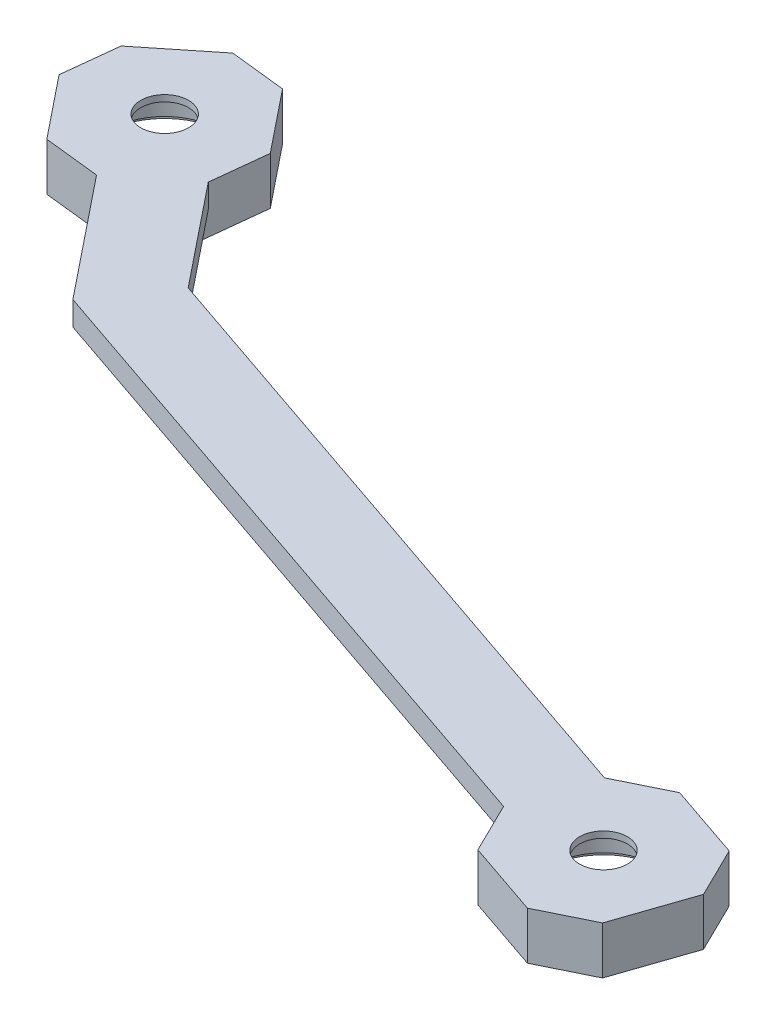
ISO-10303-21;
HEADER;
FILE_DESCRIPTION(('STEP AP214'),'2;1');
FILE_NAME('part.step','',(''),(''),'','','');
FILE_SCHEMA(('AUTOMOTIVE_DESIGN { 1 0 10303 214 1 1 1 1 }'));
ENDSEC;
DATA;
#1=APPLICATION_CONTEXT('core data for automotive mechanical design processes');
#2=APPLICATION_PROTOCOL_DEFINITION('international standard','automotive_design',2000,#1);
#3=PRODUCT_CONTEXT('',#1,'mechanical');
#4=PRODUCT('Part','Part','',(#3));
#5=PRODUCT_RELATED_PRODUCT_CATEGORY('part','',(#4));
#6=PRODUCT_DEFINITION_FORMATION('','',#4);
#7=PRODUCT_DEFINITION_CONTEXT('part definition',#1,'design');
#8=PRODUCT_DEFINITION('design','',#6,#7);
#9=PRODUCT_DEFINITION_SHAPE('','',#8);
#10=(LENGTH_UNIT() NAMED_UNIT(*) SI_UNIT(.MILLI.,.METRE.));
#11=(NAMED_UNIT(*) PLANE_ANGLE_UNIT() SI_UNIT($,.RADIAN.));
#12=(NAMED_UNIT(*) SI_UNIT($,.STERADIAN.) SOLID_ANGLE_UNIT());
#13=UNCERTAINTY_MEASURE_WITH_UNIT(LENGTH_MEASURE(1.E-05),#10,'distance_accuracy_value','');
#14=(GEOMETRIC_REPRESENTATION_CONTEXT(3) GLOBAL_UNCERTAINTY_ASSIGNED_CONTEXT((#13)) GLOBAL_UNIT_ASSIGNED_CONTEXT((#10,
#11,#12)) REPRESENTATION_CONTEXT('',''));
#15=CARTESIAN_POINT('',(0.,0.,0.));
#16=DIRECTION('',(0.,0.,1.));
#17=DIRECTION('',(1.,0.,0.));
#18=AXIS2_PLACEMENT_3D('',#15,#16,#17);
#19=CARTESIAN_POINT('',(74.766954061,-74.500004703,201.229691723));
#20=DIRECTION('',(0.228679370018642,0.707106781057643,-0.669108172054546));
#21=DIRECTION('',(-0.946261851441707,0.,-0.323401466456343));
#22=AXIS2_PLACEMENT_3D('',#19,#20,#21);
#23=PLANE('',#22);
#24=DIRECTION('',(0.359608611128638,0.577350269206526,0.733040458262219));
#25=VECTOR('',#24,1.);
#26=CARTESIAN_POINT('',(121.581452612,-77.500004703,214.05899204));
#27=LINE('',#26,#25);
#28=CARTESIAN_POINT('',(121.581452612,-77.500004703,214.05899204));
#29=VERTEX_POINT('',#28);
#30=CARTESIAN_POINT('',(123.450033768,-74.500004703,217.867981993));
#31=VERTEX_POINT('',#30);
#32=EDGE_CURVE('E295',#29,#31,#27,.T.);
#33=ORIENTED_EDGE('',*,*,#32,.T.);
#34=DIRECTION('',(-0.946261851639749,0.,-0.323401465876878));
#35=VECTOR('',#34,1.);
#36=CARTESIAN_POINT('',(123.450033768,-74.500004703,217.867981993));
#37=LINE('',#36,#35);
#38=CARTESIAN_POINT('',(41.122464529,-74.500004703,189.731101532));
#39=VERTEX_POINT('',#38);
#40=EDGE_CURVE('E327',#31,#39,#37,.T.);
#41=ORIENTED_EDGE('',*,*,#40,.T.);
#42=DIRECTION('',(-0.414389388031988,0.692646805053467,0.590357382045571));
#43=VECTOR('',#42,1.);
#44=CARTESIAN_POINT('',(42.917272729,-77.500004703,187.174138686));
#45=LINE('',#44,#43);
#46=CARTESIAN_POINT('',(42.917272729,-77.500004703,187.174138686));
#47=VERTEX_POINT('',#46);
#48=EDGE_CURVE('E10',#47,#39,#45,.T.);
#49=ORIENTED_EDGE('',*,*,#48,.F.);
#50=DIRECTION('',(0.946261851639749,0.,0.323401465876878));
#51=VECTOR('',#50,1.);
#52=CARTESIAN_POINT('',(42.917272729,-77.500004703,187.174138686));
#53=LINE('',#52,#51);
#54=EDGE_CURVE('E291',#47,#29,#53,.T.);
#55=ORIENTED_EDGE('',*,*,#54,.T.);
#56=EDGE_LOOP('',(#33,#41,#49,#55));
#57=FACE_BOUND('',#56,.T.);
#58=ADVANCED_FACE('F15',(#57),#23,.F.);
#59=CARTESIAN_POINT('',(-19.769404594,-77.500004703,109.030283541));
#60=DIRECTION('',(-0.551566324964118,-0.707106780953999,0.442464223971215));
#61=DIRECTION('',(-0.788489848802859,0.615047769148743,0.));
#62=AXIS2_PLACEMENT_3D('',#59,#60,#61);
#63=PLANE('',#62);
#64=DIRECTION('',(0.811622544300158,-0.577350269213518,0.0890814920329446));
#65=VECTOR('',#64,1.);
#66=CARTESIAN_POINT('',(29.042605868,-74.500004703,174.672611185));
#67=LINE('',#66,#65);
#68=CARTESIAN_POINT('',(29.042605868,-74.500004703,174.672611185));
#69=VERTEX_POINT('',#68);
#70=CARTESIAN_POINT('',(33.259920318,-77.500004703,175.135492197));
#71=VERTEX_POINT('',#70);
#72=EDGE_CURVE('E454',#69,#71,#67,.T.);
#73=ORIENTED_EDGE('',*,*,#72,.T.);
#74=DIRECTION('',(0.625738906105331,0.,0.780032577131304));
#75=VECTOR('',#74,1.);
#76=CARTESIAN_POINT('',(33.259920318,-77.500004703,175.135492197));
#77=LINE('',#76,#75);
#78=EDGE_CURVE('E300',#71,#47,#77,.T.);
#79=ORIENTED_EDGE('',*,*,#78,.T.);
#80=ORIENTED_EDGE('',*,*,#48,.T.);
#81=DIRECTION('',(-0.625738906105331,0.,-0.780032577131304));
#82=VECTOR('',#81,1.);
#83=CARTESIAN_POINT('',(41.122464529,-74.500004703,189.731101532));
#84=LINE('',#83,#82);
#85=EDGE_CURVE('E416',#39,#69,#84,.T.);
#86=ORIENTED_EDGE('',*,*,#85,.T.);
#87=EDGE_LOOP('',(#73,#79,#80,#86));
#88=FACE_BOUND('',#87,.T.);
#89=ADVANCED_FACE('F727',(#88),#63,.T.);
#90=CARTESIAN_POINT('',(23.761202041,-77.500004703,176.400058202));
#91=DIRECTION('',(0.228679370018642,-0.707106781057643,-0.669108172054546));
#92=DIRECTION('',(0.,0.687320942999468,-0.726353854064479));
#93=AXIS2_PLACEMENT_3D('',#90,#91,#92);
#94=PLANE('',#93);
#95=DIRECTION('',(-0.733040458262219,-0.577350269206526,0.359608611128637));
#96=VECTOR('',#95,1.);
#97=CARTESIAN_POINT('',(126.684048431,-74.500004703,208.405363478));
#98=LINE('',#97,#96);
#99=CARTESIAN_POINT('',(126.684048431,-74.500004703,208.405363478));
#100=VERTEX_POINT('',#99);
#101=CARTESIAN_POINT('',(122.875058477,-77.500004703,210.273944634));
#102=VERTEX_POINT('',#101);
#103=EDGE_CURVE('E591',#100,#102,#98,.T.);
#104=ORIENTED_EDGE('',*,*,#103,.T.);
#105=DIRECTION('',(-0.946261851639749,0.,-0.323401465876878));
#106=VECTOR('',#105,1.);
#107=CARTESIAN_POINT('',(122.875058477,-77.500004703,210.273944634));
#108=LINE('',#107,#106);
#109=CARTESIAN_POINT('',(45.310350329,-77.500004703,183.764854892));
#110=VERTEX_POINT('',#109);
#111=EDGE_CURVE('E358',#102,#110,#108,.T.);
#112=ORIENTED_EDGE('',*,*,#111,.T.);
#113=DIRECTION('',(-0.414389388031988,-0.692646805053467,0.590357382045571));
#114=VECTOR('',#113,1.);
#115=CARTESIAN_POINT('',(47.105158529,-74.500004703,181.207892047));
#116=LINE('',#115,#114);
#117=CARTESIAN_POINT('',(47.105158529,-74.500004703,181.207892047));
#118=VERTEX_POINT('',#117);
#119=EDGE_CURVE('E26',#118,#110,#116,.T.);
#120=ORIENTED_EDGE('',*,*,#119,.F.);
#121=DIRECTION('',(0.946261851639749,0.,0.323401465876878));
#122=VECTOR('',#121,1.);
#123=CARTESIAN_POINT('',(47.105158529,-74.500004703,181.207892047));
#124=LINE('',#123,#122);
#125=EDGE_CURVE('E390',#118,#100,#124,.T.);
#126=ORIENTED_EDGE('',*,*,#125,.T.);
#127=EDGE_LOOP('',(#104,#112,#120,#126));
#128=FACE_BOUND('',#127,.T.);
#129=ADVANCED_FACE('F733',(#128),#94,.T.);
#130=CARTESIAN_POINT('',(41.974045084,-74.500004703,174.811557084));
#131=DIRECTION('',(-0.551566324964118,0.707106780953999,0.442464223971215));
#132=DIRECTION('',(0.625738906199191,0.,0.78003257705601));
#133=AXIS2_PLACEMENT_3D('',#130,#131,#132);
#134=PLANE('',#133);
#135=DIRECTION('',(0.0890814920329446,0.577350269213518,-0.811622544300158));
#136=VECTOR('',#135,1.);
#137=CARTESIAN_POINT('',(36.380050626,-77.500004703,172.632536571));
#138=LINE('',#137,#136);
#139=CARTESIAN_POINT('',(36.380050626,-77.500004703,172.632536571));
#140=VERTEX_POINT('',#139);
#141=CARTESIAN_POINT('',(36.842931638,-74.500004703,168.415222122));
#142=VERTEX_POINT('',#141);
#143=EDGE_CURVE('E352',#140,#142,#138,.T.);
#144=ORIENTED_EDGE('',*,*,#143,.T.);
#145=DIRECTION('',(0.625738906105331,0.,0.780032577131304));
#146=VECTOR('',#145,1.);
#147=CARTESIAN_POINT('',(36.842931638,-74.500004703,168.415222122));
#148=LINE('',#147,#146);
#149=EDGE_CURVE('E353',#142,#118,#148,.T.);
#150=ORIENTED_EDGE('',*,*,#149,.T.);
#151=ORIENTED_EDGE('',*,*,#119,.T.);
#152=DIRECTION('',(-0.625738906105331,0.,-0.780032577131304));
#153=VECTOR('',#152,1.);
#154=CARTESIAN_POINT('',(45.310350329,-77.500004703,183.764854892));
#155=LINE('',#154,#153);
#156=EDGE_CURVE('E441',#110,#140,#155,.T.);
#157=ORIENTED_EDGE('',*,*,#156,.T.);
#158=EDGE_LOOP('',(#144,#150,#151,#157));
#159=FACE_BOUND('',#158,.T.);
#160=ADVANCED_FACE('F632',(#159),#134,.F.);
#161=CARTESIAN_POINT('',(-0.398787476,-72.300004703,-49.902779812));
#162=DIRECTION('',(0.,-1.,0.));
#163=DIRECTION('',(0.,0.,-1.));
#164=AXIS2_PLACEMENT_3D('',#161,#162,#163);
#165=PLANE('',#164);
#166=CARTESIAN_POINT('',(26.68537969,-72.300004703,163.743590884));
#167=DIRECTION('',(0.,1.,0.));
#168=DIRECTION('',(0.958322574538044,0.,-0.285688367160398));
#169=AXIS2_PLACEMENT_3D('',#166,#167,#168);
#170=CIRCLE('',#169,6.7);
#171=CARTESIAN_POINT('',(20.264618441,-72.300004703,165.657702945));
#172=VERTEX_POINT('',#171);
#173=CARTESIAN_POINT('',(33.106140939,-72.300004703,161.829478822));
#174=VERTEX_POINT('',#173);
#175=EDGE_CURVE('E378',#172,#174,#170,.T.);
#176=ORIENTED_EDGE('',*,*,#175,.F.);
#177=CARTESIAN_POINT('',(26.68537969,-72.300004703,163.743590884));
#178=DIRECTION('',(0.,1.,0.));
#179=DIRECTION('',(0.958322574538044,0.,-0.285688367160398));
#180=AXIS2_PLACEMENT_3D('',#177,#178,#179);
#181=CIRCLE('',#180,6.7);
#182=EDGE_CURVE('E39',#174,#172,#181,.T.);
#183=ORIENTED_EDGE('',*,*,#182,.F.);
#184=EDGE_LOOP('',(#176,#183));
#185=FACE_BOUND('',#184,.T.);
#186=CARTESIAN_POINT('',(26.68537969,-72.300004703,163.743590884));
#187=DIRECTION('',(0.,1.,0.));
#188=DIRECTION('',(0.285688367160398,0.,0.958322574538044));
#189=AXIS2_PLACEMENT_3D('',#186,#187,#188);
#190=CIRCLE('',#189,3.);
#191=CARTESIAN_POINT('',(27.542444792,-72.300004703,166.618558607));
#192=VERTEX_POINT('',#191);
#193=CARTESIAN_POINT('',(23.810411966,-72.300004703,164.600655986));
#194=VERTEX_POINT('',#193);
#195=EDGE_CURVE('E450',#192,#194,#190,.T.);
#196=ORIENTED_EDGE('',*,*,#195,.T.);
#197=CARTESIAN_POINT('',(26.68537969,-72.300004703,163.743590884));
#198=DIRECTION('',(0.,1.,0.));
#199=DIRECTION('',(0.285688367160398,0.,0.958322574538044));
#200=AXIS2_PLACEMENT_3D('',#197,#198,#199);
#201=CIRCLE('',#200,3.);
#202=EDGE_CURVE('E336',#194,#192,#201,.T.);
#203=ORIENTED_EDGE('',*,*,#202,.T.);
#204=EDGE_LOOP('',(#196,#203));
#205=FACE_BOUND('',#204,.T.);
#206=ADVANCED_FACE('F629',(#185,#205),#165,.T.);
#207=CARTESIAN_POINT('',(26.68537969,-76.500004703,163.743590884));
#208=DIRECTION('',(0.,1.,0.));
#209=DIRECTION('',(-0.958322574538044,0.,0.285688367160398));
#210=AXIS2_PLACEMENT_3D('',#207,#208,#209);
#211=CYLINDRICAL_SURFACE('',#210,6.7);
#212=DIRECTION('',(0.,-1.,0.));
#213=VECTOR('',#212,1.);
#214=CARTESIAN_POINT('',(20.264618441,-72.300004703,165.657702945));
#215=LINE('',#214,#213);
#216=CARTESIAN_POINT('',(20.264618441,-76.500004703,165.657702945));
#217=VERTEX_POINT('',#216);
#218=EDGE_CURVE('E369',#172,#217,#215,.T.);
#219=ORIENTED_EDGE('',*,*,#218,.F.);
#220=ORIENTED_EDGE('',*,*,#175,.T.);
#221=ORIENTED_EDGE('',*,*,#182,.T.);
#222=ORIENTED_EDGE('',*,*,#218,.T.);
#223=CARTESIAN_POINT('',(26.68537969,-76.500004703,163.743590884));
#224=DIRECTION('',(0.,1.,0.));
#225=DIRECTION('',(0.958322574538044,0.,-0.285688367160398));
#226=AXIS2_PLACEMENT_3D('',#223,#224,#225);
#227=CIRCLE('',#226,6.7);
#228=CARTESIAN_POINT('',(33.106140939,-76.500004703,161.829478822));
#229=VERTEX_POINT('',#228);
#230=EDGE_CURVE('E362',#229,#217,#227,.T.);
#231=ORIENTED_EDGE('',*,*,#230,.F.);
#232=CARTESIAN_POINT('',(26.68537969,-76.500004703,163.743590884));
#233=DIRECTION('',(0.,1.,0.));
#234=DIRECTION('',(0.958322574538044,0.,-0.285688367160398));
#235=AXIS2_PLACEMENT_3D('',#232,#233,#234);
#236=CIRCLE('',#235,6.7);
#237=EDGE_CURVE('E463',#217,#229,#236,.T.);
#238=ORIENTED_EDGE('',*,*,#237,.F.);
#239=EDGE_LOOP('',(#219,#220,#221,#222,#231,#238));
#240=FACE_BOUND('',#239,.T.);
#241=ADVANCED_FACE('F628',(#240),#211,.F.);
#242=CARTESIAN_POINT('',(107.445492449,-72.300004703,2.724316702));
#243=DIRECTION('',(0.,-1.,0.));
#244=DIRECTION('',(0.,0.,-1.));
#245=AXIS2_PLACEMENT_3D('',#242,#243,#244);
#246=PLANE('',#245);
#247=CARTESIAN_POINT('',(134.529659615,-72.300004703,216.370687398));
#248=DIRECTION('',(0.,1.,0.));
#249=DIRECTION('',(0.958322574538044,0.,-0.285688367160398));
#250=AXIS2_PLACEMENT_3D('',#247,#248,#249);
#251=CIRCLE('',#250,6.7);
#252=CARTESIAN_POINT('',(128.108898366,-72.300004703,218.284799459));
#253=VERTEX_POINT('',#252);
#254=CARTESIAN_POINT('',(140.950420864,-72.300004703,214.456575336));
#255=VERTEX_POINT('',#254);
#256=EDGE_CURVE('E370',#253,#255,#251,.T.);
#257=ORIENTED_EDGE('',*,*,#256,.F.);
#258=CARTESIAN_POINT('',(134.529659615,-72.300004703,216.370687398));
#259=DIRECTION('',(0.,1.,0.));
#260=DIRECTION('',(0.958322574538044,0.,-0.285688367160398));
#261=AXIS2_PLACEMENT_3D('',#258,#259,#260);
#262=CIRCLE('',#261,6.7);
#263=EDGE_CURVE('E367',#255,#253,#262,.T.);
#264=ORIENTED_EDGE('',*,*,#263,.F.);
#265=EDGE_LOOP('',(#257,#264));
#266=FACE_BOUND('',#265,.T.);
#267=CARTESIAN_POINT('',(134.529659615,-72.300004703,216.370687398));
#268=DIRECTION('',(0.,1.,0.));
#269=DIRECTION('',(0.285688367160398,0.,0.958322574538044));
#270=AXIS2_PLACEMENT_3D('',#267,#268,#269);
#271=CIRCLE('',#270,3.);
#272=CARTESIAN_POINT('',(135.386724717,-72.300004703,219.245655121));
#273=VERTEX_POINT('',#272);
#274=CARTESIAN_POINT('',(131.654691891,-72.300004703,217.2277525));
#275=VERTEX_POINT('',#274);
#276=EDGE_CURVE('E501',#273,#275,#271,.T.);
#277=ORIENTED_EDGE('',*,*,#276,.T.);
#278=CARTESIAN_POINT('',(134.529659615,-72.300004703,216.370687398));
#279=DIRECTION('',(0.,1.,0.));
#280=DIRECTION('',(0.285688367160398,0.,0.958322574538044));
#281=AXIS2_PLACEMENT_3D('',#278,#279,#280);
#282=CIRCLE('',#281,3.);
#283=EDGE_CURVE('E505',#275,#273,#282,.T.);
#284=ORIENTED_EDGE('',*,*,#283,.T.);
#285=EDGE_LOOP('',(#277,#284));
#286=FACE_BOUND('',#285,.T.);
#287=ADVANCED_FACE('F710',(#266,#286),#246,.T.);
#288=CARTESIAN_POINT('',(134.529659615,-76.500004703,216.370687398));
#289=DIRECTION('',(0.,1.,0.));
#290=DIRECTION('',(-0.958322574538044,0.,0.285688367160398));
#291=AXIS2_PLACEMENT_3D('',#288,#289,#290);
#292=CYLINDRICAL_SURFACE('',#291,6.7);
#293=DIRECTION('',(0.,-1.,0.));
#294=VECTOR('',#293,1.);
#295=CARTESIAN_POINT('',(128.108898366,-72.300004703,218.284799459));
#296=LINE('',#295,#294);
#297=CARTESIAN_POINT('',(128.108898366,-76.500004703,218.284799459));
#298=VERTEX_POINT('',#297);
#299=EDGE_CURVE('E365',#253,#298,#296,.T.);
#300=ORIENTED_EDGE('',*,*,#299,.F.);
#301=ORIENTED_EDGE('',*,*,#256,.T.);
#302=ORIENTED_EDGE('',*,*,#263,.T.);
#303=ORIENTED_EDGE('',*,*,#299,.T.);
#304=CARTESIAN_POINT('',(134.529659615,-76.500004703,216.370687398));
#305=DIRECTION('',(0.,1.,0.));
#306=DIRECTION('',(0.958322574538044,0.,-0.285688367160398));
#307=AXIS2_PLACEMENT_3D('',#304,#305,#306);
#308=CIRCLE('',#307,6.7);
#309=CARTESIAN_POINT('',(140.950420864,-76.500004703,214.456575336));
#310=VERTEX_POINT('',#309);
#311=EDGE_CURVE('E366',#310,#298,#308,.T.);
#312=ORIENTED_EDGE('',*,*,#311,.F.);
#313=CARTESIAN_POINT('',(134.529659615,-76.500004703,216.370687398));
#314=DIRECTION('',(0.,1.,0.));
#315=DIRECTION('',(0.958322574538044,0.,-0.285688367160398));
#316=AXIS2_PLACEMENT_3D('',#313,#314,#315);
#317=CIRCLE('',#316,6.7);
#318=EDGE_CURVE('E363',#298,#310,#317,.T.);
#319=ORIENTED_EDGE('',*,*,#318,.F.);
#320=EDGE_LOOP('',(#300,#301,#302,#303,#312,#319));
#321=FACE_BOUND('',#320,.T.);
#322=ADVANCED_FACE('F712',(#321),#292,.F.);
#323=CARTESIAN_POINT('',(107.445492449,-76.500004703,2.724316702));
#324=DIRECTION('',(0.,-1.,0.));
#325=DIRECTION('',(0.,0.,-1.));
#326=AXIS2_PLACEMENT_3D('',#323,#324,#325);
#327=PLANE('',#326);
#328=CARTESIAN_POINT('',(134.529659615,-76.500004703,216.370687398));
#329=DIRECTION('',(0.,1.,0.));
#330=DIRECTION('',(0.958322574538044,0.,-0.285688367160398));
#331=AXIS2_PLACEMENT_3D('',#328,#329,#330);
#332=CIRCLE('',#331,7.8);
#333=CARTESIAN_POINT('',(127.054743534,-76.500004703,218.599056663));
#334=VERTEX_POINT('',#333);
#335=CARTESIAN_POINT('',(142.004575696,-76.500004703,214.142318132));
#336=VERTEX_POINT('',#335);
#337=EDGE_CURVE('E462',#334,#336,#332,.T.);
#338=ORIENTED_EDGE('',*,*,#337,.F.);
#339=CARTESIAN_POINT('',(134.529659615,-76.500004703,216.370687398));
#340=DIRECTION('',(0.,1.,0.));
#341=DIRECTION('',(0.958322574538044,0.,-0.285688367160398));
#342=AXIS2_PLACEMENT_3D('',#339,#340,#341);
#343=CIRCLE('',#342,7.8);
#344=EDGE_CURVE('E470',#336,#334,#343,.T.);
#345=ORIENTED_EDGE('',*,*,#344,.F.);
#346=EDGE_LOOP('',(#338,#345));
#347=FACE_BOUND('',#346,.T.);
#348=ORIENTED_EDGE('',*,*,#311,.T.);
#349=ORIENTED_EDGE('',*,*,#318,.T.);
#350=EDGE_LOOP('',(#348,#349));
#351=FACE_BOUND('',#350,.T.);
#352=ADVANCED_FACE('F721',(#347,#351),#327,.T.);
#353=CARTESIAN_POINT('',(134.529659615,-77.500004703,216.370687398));
#354=DIRECTION('',(0.,1.,0.));
#355=DIRECTION('',(-0.958322574538044,0.,0.285688367160398));
#356=AXIS2_PLACEMENT_3D('',#353,#354,#355);
#357=CYLINDRICAL_SURFACE('',#356,7.8);
#358=DIRECTION('',(0.,-1.,0.));
#359=VECTOR('',#358,1.);
#360=CARTESIAN_POINT('',(127.054743534,-76.500004703,218.599056663));
#361=LINE('',#360,#359);
#362=CARTESIAN_POINT('',(127.054743534,-77.500004703,218.599056663));
#363=VERTEX_POINT('',#362);
#364=EDGE_CURVE('E459',#334,#363,#361,.T.);
#365=ORIENTED_EDGE('',*,*,#364,.F.);
#366=ORIENTED_EDGE('',*,*,#337,.T.);
#367=ORIENTED_EDGE('',*,*,#344,.T.);
#368=ORIENTED_EDGE('',*,*,#364,.T.);
#369=CARTESIAN_POINT('',(134.529659615,-77.500004703,216.370687398));
#370=DIRECTION('',(0.,1.,0.));
#371=DIRECTION('',(0.958322574538044,0.,-0.285688367160398));
#372=AXIS2_PLACEMENT_3D('',#369,#370,#371);
#373=CIRCLE('',#372,7.8);
#374=CARTESIAN_POINT('',(142.004575696,-77.500004703,214.142318132));
#375=VERTEX_POINT('',#374);
#376=EDGE_CURVE('E341',#375,#363,#373,.T.);
#377=ORIENTED_EDGE('',*,*,#376,.F.);
#378=CARTESIAN_POINT('',(134.529659615,-77.500004703,216.370687398));
#379=DIRECTION('',(0.,1.,0.));
#380=DIRECTION('',(0.958322574538044,0.,-0.285688367160398));
#381=AXIS2_PLACEMENT_3D('',#378,#379,#380);
#382=CIRCLE('',#381,7.8);
#383=EDGE_CURVE('E337',#363,#375,#382,.T.);
#384=ORIENTED_EDGE('',*,*,#383,.F.);
#385=EDGE_LOOP('',(#365,#366,#367,#368,#377,#384));
#386=FACE_BOUND('',#385,.T.);
#387=ADVANCED_FACE('F741',(#386),#357,.F.);
#388=CARTESIAN_POINT('',(-0.398787476,-76.500004703,-49.902779812));
#389=DIRECTION('',(0.,-1.,0.));
#390=DIRECTION('',(0.,0.,-1.));
#391=AXIS2_PLACEMENT_3D('',#388,#389,#390);
#392=PLANE('',#391);
#393=CARTESIAN_POINT('',(26.68537969,-76.500004703,163.743590884));
#394=DIRECTION('',(0.,1.,0.));
#395=DIRECTION('',(0.958322574538044,0.,-0.285688367160398));
#396=AXIS2_PLACEMENT_3D('',#393,#394,#395);
#397=CIRCLE('',#396,7.8);
#398=CARTESIAN_POINT('',(19.210463609,-76.500004703,165.971960149));
#399=VERTEX_POINT('',#398);
#400=CARTESIAN_POINT('',(34.160295771,-76.500004703,161.515221618));
#401=VERTEX_POINT('',#400);
#402=EDGE_CURVE('E357',#399,#401,#397,.T.);
#403=ORIENTED_EDGE('',*,*,#402,.F.);
#404=CARTESIAN_POINT('',(26.68537969,-76.500004703,163.743590884));
#405=DIRECTION('',(0.,1.,0.));
#406=DIRECTION('',(0.958322574538044,0.,-0.285688367160398));
#407=AXIS2_PLACEMENT_3D('',#404,#405,#406);
#408=CIRCLE('',#407,7.8);
#409=EDGE_CURVE('E359',#401,#399,#408,.T.);
#410=ORIENTED_EDGE('',*,*,#409,.F.);
#411=EDGE_LOOP('',(#403,#410));
#412=FACE_BOUND('',#411,.T.);
#413=ORIENTED_EDGE('',*,*,#230,.T.);
#414=ORIENTED_EDGE('',*,*,#237,.T.);
#415=EDGE_LOOP('',(#413,#414));
#416=FACE_BOUND('',#415,.T.);
#417=ADVANCED_FACE('F17',(#412,#416),#392,.T.);
#418=CARTESIAN_POINT('',(26.68537969,-77.500004703,163.743590884));
#419=DIRECTION('',(0.,1.,0.));
#420=DIRECTION('',(-0.958322574538044,0.,0.285688367160398));
#421=AXIS2_PLACEMENT_3D('',#418,#419,#420);
#422=CYLINDRICAL_SURFACE('',#421,7.8);
#423=DIRECTION('',(0.,-1.,0.));
#424=VECTOR('',#423,1.);
#425=CARTESIAN_POINT('',(19.210463609,-76.500004703,165.971960149));
#426=LINE('',#425,#424);
#427=CARTESIAN_POINT('',(19.210463609,-77.500004703,165.971960149));
#428=VERTEX_POINT('',#427);
#429=EDGE_CURVE('E354',#399,#428,#426,.T.);
#430=ORIENTED_EDGE('',*,*,#429,.F.);
#431=ORIENTED_EDGE('',*,*,#402,.T.);
#432=ORIENTED_EDGE('',*,*,#409,.T.);
#433=ORIENTED_EDGE('',*,*,#429,.T.);
#434=CARTESIAN_POINT('',(26.68537969,-77.500004703,163.743590884));
#435=DIRECTION('',(0.,1.,0.));
#436=DIRECTION('',(0.958322574538044,0.,-0.285688367160398));
#437=AXIS2_PLACEMENT_3D('',#434,#435,#436);
#438=CIRCLE('',#437,7.8);
#439=CARTESIAN_POINT('',(34.160295771,-77.500004703,161.515221618));
#440=VERTEX_POINT('',#439);
#441=EDGE_CURVE('E340',#440,#428,#438,.T.);
#442=ORIENTED_EDGE('',*,*,#441,.F.);
#443=CARTESIAN_POINT('',(26.68537969,-77.500004703,163.743590884));
#444=DIRECTION('',(0.,1.,0.));
#445=DIRECTION('',(0.958322574538044,0.,-0.285688367160398));
#446=AXIS2_PLACEMENT_3D('',#443,#444,#445);
#447=CIRCLE('',#446,7.8);
#448=EDGE_CURVE('E301',#428,#440,#447,.T.);
#449=ORIENTED_EDGE('',*,*,#448,.F.);
#450=EDGE_LOOP('',(#430,#431,#432,#433,#442,#449));
#451=FACE_BOUND('',#450,.T.);
#452=ADVANCED_FACE('F643',(#451),#422,.F.);
#453=CARTESIAN_POINT('',(71.925465233,-71.500004703,35.4730383));
#454=DIRECTION('',(0.,-1.,0.));
#455=DIRECTION('',(0.,0.,-1.));
#456=AXIS2_PLACEMENT_3D('',#453,#454,#455);
#457=PLANE('',#456);
#458=CARTESIAN_POINT('',(26.68537969,-71.500004703,163.743590884));
#459=DIRECTION('',(0.,1.,0.));
#460=DIRECTION('',(0.285688367160398,0.,0.958322574538044));
#461=AXIS2_PLACEMENT_3D('',#458,#459,#460);
#462=CIRCLE('',#461,3.);
#463=CARTESIAN_POINT('',(23.810411966,-71.500004703,164.600655986));
#464=VERTEX_POINT('',#463);
#465=CARTESIAN_POINT('',(27.542444792,-71.500004703,166.618558607));
#466=VERTEX_POINT('',#465);
#467=EDGE_CURVE('E342',#464,#466,#462,.T.);
#468=ORIENTED_EDGE('',*,*,#467,.F.);
#469=CARTESIAN_POINT('',(26.68537969,-71.500004703,163.743590884));
#470=DIRECTION('',(0.,1.,0.));
#471=DIRECTION('',(0.285688367160398,0.,0.958322574538044));
#472=AXIS2_PLACEMENT_3D('',#469,#470,#471);
#473=CIRCLE('',#472,3.);
#474=EDGE_CURVE('E346',#466,#464,#473,.T.);
#475=ORIENTED_EDGE('',*,*,#474,.F.);
#476=EDGE_LOOP('',(#468,#475));
#477=FACE_BOUND('',#476,.T.);
#478=CARTESIAN_POINT('',(134.529659615,-71.500004703,216.370687398));
#479=DIRECTION('',(0.,1.,0.));
#480=DIRECTION('',(0.285688367160398,0.,0.958322574538044));
#481=AXIS2_PLACEMENT_3D('',#478,#479,#480);
#482=CIRCLE('',#481,3.);
#483=CARTESIAN_POINT('',(131.654691891,-71.500004703,217.2277525));
#484=VERTEX_POINT('',#483);
#485=CARTESIAN_POINT('',(135.386724717,-71.500004703,219.245655121));
#486=VERTEX_POINT('',#485);
#487=EDGE_CURVE('E491',#484,#486,#482,.T.);
#488=ORIENTED_EDGE('',*,*,#487,.F.);
#489=CARTESIAN_POINT('',(134.529659615,-71.500004703,216.370687398));
#490=DIRECTION('',(0.,1.,0.));
#491=DIRECTION('',(0.285688367160398,0.,0.958322574538044));
#492=AXIS2_PLACEMENT_3D('',#489,#490,#491);
#493=CIRCLE('',#492,3.);
#494=EDGE_CURVE('E506',#486,#484,#493,.T.);
#495=ORIENTED_EDGE('',*,*,#494,.F.);
#496=EDGE_LOOP('',(#488,#495));
#497=FACE_BOUND('',#496,.T.);
#498=DIRECTION('',(-0.323401465876878,0.,0.946261851639749));
#499=VECTOR('',#498,1.);
#500=CARTESIAN_POINT('',(145.609285461,-71.500004703,214.873392802));
#501=LINE('',#500,#499);
#502=CARTESIAN_POINT('',(145.609285461,-71.500004703,214.873392802));
#503=VERTEX_POINT('',#502);
#504=CARTESIAN_POINT('',(142.375270799,-71.500004703,224.336011317));
#505=VERTEX_POINT('',#504);
#506=EDGE_CURVE('E331',#503,#505,#501,.T.);
#507=ORIENTED_EDGE('',*,*,#506,.F.);
#508=DIRECTION('',(-0.440428801955614,0.,-0.897787541909522));
#509=VECTOR('',#508,1.);
#510=CARTESIAN_POINT('',(145.609285461,-71.500004703,214.873392802));
#511=LINE('',#510,#509);
#512=CARTESIAN_POINT('',(142.494983534,-71.500004703,208.525076213));
#513=VERTEX_POINT('',#512);
#514=EDGE_CURVE('E407',#503,#513,#511,.T.);
#515=ORIENTED_EDGE('',*,*,#514,.T.);
#516=DIRECTION('',(-0.946261851639749,0.,-0.323401465876878));
#517=VECTOR('',#516,1.);
#518=CARTESIAN_POINT('',(142.494983534,-71.500004703,208.525076213));
#519=LINE('',#518,#517);
#520=CARTESIAN_POINT('',(133.032365019,-71.500004703,205.291061551));
#521=VERTEX_POINT('',#520);
#522=EDGE_CURVE('E511',#513,#521,#519,.T.);
#523=ORIENTED_EDGE('',*,*,#522,.T.);
#524=DIRECTION('',(0.897787541909522,0.,-0.440428801955614));
#525=VECTOR('',#524,1.);
#526=CARTESIAN_POINT('',(126.684048431,-71.500004703,208.405363478));
#527=LINE('',#526,#525);
#528=CARTESIAN_POINT('',(126.684048431,-71.500004703,208.405363478));
#529=VERTEX_POINT('',#528);
#530=EDGE_CURVE('E446',#529,#521,#527,.T.);
#531=ORIENTED_EDGE('',*,*,#530,.F.);
#532=DIRECTION('',(-0.946261851639749,0.,-0.323401465876878));
#533=VECTOR('',#532,1.);
#534=CARTESIAN_POINT('',(126.684048431,-71.500004703,208.405363478));
#535=LINE('',#534,#533);
#536=CARTESIAN_POINT('',(47.105158529,-71.500004703,181.207892047));
#537=VERTEX_POINT('',#536);
#538=EDGE_CURVE('E394',#529,#537,#535,.T.);
#539=ORIENTED_EDGE('',*,*,#538,.T.);
#540=DIRECTION('',(0.625738906105331,0.,0.780032577131304));
#541=VECTOR('',#540,1.);
#542=CARTESIAN_POINT('',(36.842931638,-71.500004703,168.415222122));
#543=LINE('',#542,#541);
#544=CARTESIAN_POINT('',(36.842931638,-71.500004703,168.415222122));
#545=VERTEX_POINT('',#544);
#546=EDGE_CURVE('E562',#545,#537,#543,.T.);
#547=ORIENTED_EDGE('',*,*,#546,.F.);
#548=DIRECTION('',(0.109102100957022,0.,-0.994030548608424));
#549=VECTOR('',#548,1.);
#550=CARTESIAN_POINT('',(36.842931638,-71.500004703,168.415222122));
#551=LINE('',#550,#549);
#552=CARTESIAN_POINT('',(37.614399991,-71.500004703,161.386364705));
#553=VERTEX_POINT('',#552);
#554=EDGE_CURVE('E348',#545,#553,#551,.T.);
#555=ORIENTED_EDGE('',*,*,#554,.T.);
#556=DIRECTION('',(0.625738906105331,0.,0.780032577131304));
#557=VECTOR('',#556,1.);
#558=CARTESIAN_POINT('',(31.357010928,-71.500004703,153.586038936));
#559=LINE('',#558,#557);
#560=CARTESIAN_POINT('',(31.357010928,-71.500004703,153.586038936));
#561=VERTEX_POINT('',#560);
#562=EDGE_CURVE('E496',#561,#553,#559,.T.);
#563=ORIENTED_EDGE('',*,*,#562,.F.);
#564=DIRECTION('',(-0.994030548608424,0.,-0.109102100957022));
#565=VECTOR('',#564,1.);
#566=CARTESIAN_POINT('',(31.357010928,-71.500004703,153.586038936));
#567=LINE('',#566,#565);
#568=CARTESIAN_POINT('',(24.328153512,-71.500004703,152.814570582));
#569=VERTEX_POINT('',#568);
#570=EDGE_CURVE('E423',#561,#569,#567,.T.);
#571=ORIENTED_EDGE('',*,*,#570,.T.);
#572=DIRECTION('',(0.780032577131304,0.,-0.625738906105331));
#573=VECTOR('',#572,1.);
#574=CARTESIAN_POINT('',(16.527827742,-71.500004703,159.071959646));
#575=LINE('',#574,#573);
#576=CARTESIAN_POINT('',(16.527827742,-71.500004703,159.071959646));
#577=VERTEX_POINT('',#576);
#578=EDGE_CURVE('E474',#577,#569,#575,.T.);
#579=ORIENTED_EDGE('',*,*,#578,.F.);
#580=DIRECTION('',(0.109102100957022,0.,-0.994030548608424));
#581=VECTOR('',#580,1.);
#582=CARTESIAN_POINT('',(15.756359389,-71.500004703,166.100817062));
#583=LINE('',#582,#581);
#584=CARTESIAN_POINT('',(15.756359389,-71.500004703,166.100817062));
#585=VERTEX_POINT('',#584);
#586=EDGE_CURVE('E558',#585,#577,#583,.T.);
#587=ORIENTED_EDGE('',*,*,#586,.F.);
#588=DIRECTION('',(0.625738906105331,0.,0.780032577131304));
#589=VECTOR('',#588,1.);
#590=CARTESIAN_POINT('',(15.756359389,-71.500004703,166.100817062));
#591=LINE('',#590,#589);
#592=CARTESIAN_POINT('',(22.013748452,-71.500004703,173.901142832));
#593=VERTEX_POINT('',#592);
#594=EDGE_CURVE('E432',#585,#593,#591,.T.);
#595=ORIENTED_EDGE('',*,*,#594,.T.);
#596=DIRECTION('',(0.994030548608424,0.,0.109102100957022));
#597=VECTOR('',#596,1.);
#598=CARTESIAN_POINT('',(22.013748452,-71.500004703,173.901142832));
#599=LINE('',#598,#597);
#600=CARTESIAN_POINT('',(29.042605868,-71.500004703,174.672611185));
#601=VERTEX_POINT('',#600);
#602=EDGE_CURVE('E519',#593,#601,#599,.T.);
#603=ORIENTED_EDGE('',*,*,#602,.T.);
#604=DIRECTION('',(0.625738906105331,0.,0.780032577131304));
#605=VECTOR('',#604,1.);
#606=CARTESIAN_POINT('',(29.042605868,-71.500004703,174.672611185));
#607=LINE('',#606,#605);
#608=CARTESIAN_POINT('',(41.122464529,-71.500004703,189.731101532));
#609=VERTEX_POINT('',#608);
#610=EDGE_CURVE('E406',#601,#609,#607,.T.);
#611=ORIENTED_EDGE('',*,*,#610,.T.);
#612=DIRECTION('',(-0.946261851639749,0.,-0.323401465876878));
#613=VECTOR('',#612,1.);
#614=CARTESIAN_POINT('',(123.450033768,-71.500004703,217.867981993));
#615=LINE('',#614,#613);
#616=CARTESIAN_POINT('',(123.450033768,-71.500004703,217.867981993));
#617=VERTEX_POINT('',#616);
#618=EDGE_CURVE('E415',#617,#609,#615,.T.);
#619=ORIENTED_EDGE('',*,*,#618,.F.);
#620=DIRECTION('',(0.440428801955614,0.,0.897787541909522));
#621=VECTOR('',#620,1.);
#622=CARTESIAN_POINT('',(123.450033768,-71.500004703,217.867981993));
#623=LINE('',#622,#621);
#624=CARTESIAN_POINT('',(126.564335695,-71.500004703,224.216298582));
#625=VERTEX_POINT('',#624);
#626=EDGE_CURVE('E320',#617,#625,#623,.T.);
#627=ORIENTED_EDGE('',*,*,#626,.T.);
#628=DIRECTION('',(-0.946261851639749,0.,-0.323401465876878));
#629=VECTOR('',#628,1.);
#630=CARTESIAN_POINT('',(136.02695421,-71.500004703,227.450313244));
#631=LINE('',#630,#629);
#632=CARTESIAN_POINT('',(136.02695421,-71.500004703,227.450313244));
#633=VERTEX_POINT('',#632);
#634=EDGE_CURVE('E431',#633,#625,#631,.T.);
#635=ORIENTED_EDGE('',*,*,#634,.F.);
#636=DIRECTION('',(0.897787541909522,0.,-0.440428801955614));
#637=VECTOR('',#636,1.);
#638=CARTESIAN_POINT('',(136.02695421,-71.500004703,227.450313244));
#639=LINE('',#638,#637);
#640=EDGE_CURVE('E398',#633,#505,#639,.T.);
#641=ORIENTED_EDGE('',*,*,#640,.T.);
#642=EDGE_LOOP('',(#507,#515,#523,#531,#539,#547,#555,#563,#571,#579,#587,#595,#603,#611,#619,
#627,#635,#641));
#643=FACE_BOUND('',#642,.T.);
#644=ADVANCED_FACE('F640',(#477,#497,#643),#457,.F.);
#645=CARTESIAN_POINT('',(71.925465233,-77.500004703,35.4730383));
#646=DIRECTION('',(0.,-1.,0.));
#647=DIRECTION('',(0.,0.,-1.));
#648=AXIS2_PLACEMENT_3D('',#645,#646,#647);
#649=PLANE('',#648);
#650=ORIENTED_EDGE('',*,*,#54,.F.);
#651=ORIENTED_EDGE('',*,*,#78,.F.);
#652=DIRECTION('',(0.994030548608424,0.,0.109102100957022));
#653=VECTOR('',#652,1.);
#654=CARTESIAN_POINT('',(22.013748452,-77.500004703,173.901142832));
#655=LINE('',#654,#653);
#656=CARTESIAN_POINT('',(22.013748452,-77.500004703,173.901142832));
#657=VERTEX_POINT('',#656);
#658=EDGE_CURVE('E458',#657,#71,#655,.T.);
#659=ORIENTED_EDGE('',*,*,#658,.F.);
#660=DIRECTION('',(0.625738906105331,0.,0.780032577131304));
#661=VECTOR('',#660,1.);
#662=CARTESIAN_POINT('',(15.756359389,-77.500004703,166.100817062));
#663=LINE('',#662,#661);
#664=CARTESIAN_POINT('',(15.756359389,-77.500004703,166.100817062));
#665=VERTEX_POINT('',#664);
#666=EDGE_CURVE('E435',#665,#657,#663,.T.);
#667=ORIENTED_EDGE('',*,*,#666,.F.);
#668=DIRECTION('',(0.109102100957022,0.,-0.994030548608424));
#669=VECTOR('',#668,1.);
#670=CARTESIAN_POINT('',(15.756359389,-77.500004703,166.100817062));
#671=LINE('',#670,#669);
#672=CARTESIAN_POINT('',(16.527827742,-77.500004703,159.071959646));
#673=VERTEX_POINT('',#672);
#674=EDGE_CURVE('E573',#665,#673,#671,.T.);
#675=ORIENTED_EDGE('',*,*,#674,.T.);
#676=DIRECTION('',(0.780032577131304,0.,-0.625738906105331));
#677=VECTOR('',#676,1.);
#678=CARTESIAN_POINT('',(16.527827742,-77.500004703,159.071959646));
#679=LINE('',#678,#677);
#680=CARTESIAN_POINT('',(24.328153512,-77.500004703,152.814570582));
#681=VERTEX_POINT('',#680);
#682=EDGE_CURVE('E471',#673,#681,#679,.T.);
#683=ORIENTED_EDGE('',*,*,#682,.T.);
#684=DIRECTION('',(-0.994030548608424,0.,-0.109102100957022));
#685=VECTOR('',#684,1.);
#686=CARTESIAN_POINT('',(31.357010928,-77.500004703,153.586038936));
#687=LINE('',#686,#685);
#688=CARTESIAN_POINT('',(31.357010928,-77.500004703,153.586038936));
#689=VERTEX_POINT('',#688);
#690=EDGE_CURVE('E427',#689,#681,#687,.T.);
#691=ORIENTED_EDGE('',*,*,#690,.F.);
#692=DIRECTION('',(0.625738906105331,0.,0.780032577131304));
#693=VECTOR('',#692,1.);
#694=CARTESIAN_POINT('',(31.357010928,-77.500004703,153.586038936));
#695=LINE('',#694,#693);
#696=CARTESIAN_POINT('',(37.614399991,-77.500004703,161.386364705));
#697=VERTEX_POINT('',#696);
#698=EDGE_CURVE('E500',#689,#697,#695,.T.);
#699=ORIENTED_EDGE('',*,*,#698,.T.);
#700=DIRECTION('',(0.109102100957022,0.,-0.994030548608424));
#701=VECTOR('',#700,1.);
#702=CARTESIAN_POINT('',(36.380050626,-77.500004703,172.632536571));
#703=LINE('',#702,#701);
#704=EDGE_CURVE('E388',#140,#697,#703,.T.);
#705=ORIENTED_EDGE('',*,*,#704,.F.);
#706=ORIENTED_EDGE('',*,*,#156,.F.);
#707=ORIENTED_EDGE('',*,*,#111,.F.);
#708=DIRECTION('',(0.897787541909522,0.,-0.440428801955614));
#709=VECTOR('',#708,1.);
#710=CARTESIAN_POINT('',(122.875058477,-77.500004703,210.273944634));
#711=LINE('',#710,#709);
#712=CARTESIAN_POINT('',(133.032365019,-77.500004703,205.291061551));
#713=VERTEX_POINT('',#712);
#714=EDGE_CURVE('E466',#102,#713,#711,.T.);
#715=ORIENTED_EDGE('',*,*,#714,.T.);
#716=DIRECTION('',(-0.946261851639749,0.,-0.323401465876878));
#717=VECTOR('',#716,1.);
#718=CARTESIAN_POINT('',(142.494983534,-77.500004703,208.525076213));
#719=LINE('',#718,#717);
#720=CARTESIAN_POINT('',(142.494983534,-77.500004703,208.525076213));
#721=VERTEX_POINT('',#720);
#722=EDGE_CURVE('E447',#721,#713,#719,.T.);
#723=ORIENTED_EDGE('',*,*,#722,.F.);
#724=DIRECTION('',(-0.440428801955614,0.,-0.897787541909522));
#725=VECTOR('',#724,1.);
#726=CARTESIAN_POINT('',(145.609285461,-77.500004703,214.873392802));
#727=LINE('',#726,#725);
#728=CARTESIAN_POINT('',(145.609285461,-77.500004703,214.873392802));
#729=VERTEX_POINT('',#728);
#730=EDGE_CURVE('E411',#729,#721,#727,.T.);
#731=ORIENTED_EDGE('',*,*,#730,.F.);
#732=DIRECTION('',(-0.323401465876878,0.,0.946261851639749));
#733=VECTOR('',#732,1.);
#734=CARTESIAN_POINT('',(145.609285461,-77.500004703,214.873392802));
#735=LINE('',#734,#733);
#736=CARTESIAN_POINT('',(142.375270799,-77.500004703,224.336011317));
#737=VERTEX_POINT('',#736);
#738=EDGE_CURVE('E547',#729,#737,#735,.T.);
#739=ORIENTED_EDGE('',*,*,#738,.T.);
#740=DIRECTION('',(0.897787541909522,0.,-0.440428801955614));
#741=VECTOR('',#740,1.);
#742=CARTESIAN_POINT('',(136.02695421,-77.500004703,227.450313244));
#743=LINE('',#742,#741);
#744=CARTESIAN_POINT('',(136.02695421,-77.500004703,227.450313244));
#745=VERTEX_POINT('',#744);
#746=EDGE_CURVE('E395',#745,#737,#743,.T.);
#747=ORIENTED_EDGE('',*,*,#746,.F.);
#748=DIRECTION('',(-0.946261851639749,0.,-0.323401465876878));
#749=VECTOR('',#748,1.);
#750=CARTESIAN_POINT('',(136.02695421,-77.500004703,227.450313244));
#751=LINE('',#750,#749);
#752=CARTESIAN_POINT('',(126.564335695,-77.500004703,224.216298582));
#753=VERTEX_POINT('',#752);
#754=EDGE_CURVE('E308',#745,#753,#751,.T.);
#755=ORIENTED_EDGE('',*,*,#754,.T.);
#756=DIRECTION('',(0.440428801955614,0.,0.897787541909522));
#757=VECTOR('',#756,1.);
#758=CARTESIAN_POINT('',(121.581452612,-77.500004703,214.05899204));
#759=LINE('',#758,#757);
#760=EDGE_CURVE('E304',#29,#753,#759,.T.);
#761=ORIENTED_EDGE('',*,*,#760,.F.);
#762=EDGE_LOOP('',(#650,#651,#659,#667,#675,#683,#691,#699,#705,#706,#707,#715,#723,#731,#739,
#747,#755,#761));
#763=FACE_BOUND('',#762,.T.);
#764=ORIENTED_EDGE('',*,*,#441,.T.);
#765=ORIENTED_EDGE('',*,*,#448,.T.);
#766=EDGE_LOOP('',(#764,#765));
#767=FACE_BOUND('',#766,.T.);
#768=ORIENTED_EDGE('',*,*,#376,.T.);
#769=ORIENTED_EDGE('',*,*,#383,.T.);
#770=EDGE_LOOP('',(#768,#769));
#771=FACE_BOUND('',#770,.T.);
#772=ADVANCED_FACE('F305',(#763,#767,#771),#649,.T.);
#773=CARTESIAN_POINT('',(139.201112505,-77.500004703,225.893162281));
#774=DIRECTION('',(-0.440428801955614,0.,-0.897787541909522));
#775=DIRECTION('',(-0.897787541909522,0.,0.440428801955614));
#776=AXIS2_PLACEMENT_3D('',#773,#774,#775);
#777=PLANE('',#776);
#778=ORIENTED_EDGE('',*,*,#640,.F.);
#779=DIRECTION('',(0.,1.,0.));
#780=VECTOR('',#779,1.);
#781=CARTESIAN_POINT('',(136.02695421,-77.500004703,227.450313244));
#782=LINE('',#781,#780);
#783=EDGE_CURVE('E417',#745,#633,#782,.T.);
#784=ORIENTED_EDGE('',*,*,#783,.F.);
#785=ORIENTED_EDGE('',*,*,#746,.T.);
#786=DIRECTION('',(0.,1.,0.));
#787=VECTOR('',#786,1.);
#788=CARTESIAN_POINT('',(142.375270799,-77.500004703,224.336011317));
#789=LINE('',#788,#787);
#790=EDGE_CURVE('E335',#737,#505,#789,.T.);
#791=ORIENTED_EDGE('',*,*,#790,.T.);
#792=EDGE_LOOP('',(#778,#784,#785,#791));
#793=FACE_BOUND('',#792,.T.);
#794=ADVANCED_FACE('F1030',(#793),#777,.F.);
#795=CARTESIAN_POINT('',(84.713381241,-77.500004703,209.913006093));
#796=DIRECTION('',(-0.323401465876878,0.,0.946261851639749));
#797=DIRECTION('',(0.,1.,0.));
#798=AXIS2_PLACEMENT_3D('',#795,#796,#797);
#799=PLANE('',#798);
#800=ORIENTED_EDGE('',*,*,#634,.T.);
#801=DIRECTION('',(0.,1.,0.));
#802=VECTOR('',#801,1.);
#803=CARTESIAN_POINT('',(126.564335695,-77.500004703,224.216298582));
#804=LINE('',#803,#802);
#805=EDGE_CURVE('E313',#753,#625,#804,.T.);
#806=ORIENTED_EDGE('',*,*,#805,.F.);
#807=ORIENTED_EDGE('',*,*,#754,.F.);
#808=ORIENTED_EDGE('',*,*,#783,.T.);
#809=EDGE_LOOP('',(#800,#806,#807,#808));
#810=FACE_BOUND('',#809,.T.);
#811=ADVANCED_FACE('F967',(#810),#799,.T.);
#812=CARTESIAN_POINT('',(125.007184732,-77.500004703,221.042140287));
#813=DIRECTION('',(0.897787541909522,0.,-0.440428801955614));
#814=DIRECTION('',(0.,-1.,0.));
#815=AXIS2_PLACEMENT_3D('',#812,#813,#814);
#816=PLANE('',#815);
#817=ORIENTED_EDGE('',*,*,#626,.F.);
#818=DIRECTION('',(0.,1.,0.));
#819=VECTOR('',#818,1.);
#820=CARTESIAN_POINT('',(123.450033768,-74.500004703,217.867981993));
#821=LINE('',#820,#819);
#822=EDGE_CURVE('E318',#31,#617,#821,.T.);
#823=ORIENTED_EDGE('',*,*,#822,.F.);
#824=ORIENTED_EDGE('',*,*,#32,.F.);
#825=ORIENTED_EDGE('',*,*,#760,.T.);
#826=ORIENTED_EDGE('',*,*,#805,.T.);
#827=EDGE_LOOP('',(#817,#823,#824,#825,#826));
#828=FACE_BOUND('',#827,.T.);
#829=ADVANCED_FACE('F316',(#828),#816,.F.);
#830=CARTESIAN_POINT('',(74.766954061,-77.500004703,201.229691723));
#831=DIRECTION('',(-0.323401465876878,0.,0.946261851639749));
#832=DIRECTION('',(0.,1.,0.));
#833=AXIS2_PLACEMENT_3D('',#830,#831,#832);
#834=PLANE('',#833);
#835=ORIENTED_EDGE('',*,*,#822,.T.);
#836=ORIENTED_EDGE('',*,*,#618,.T.);
#837=DIRECTION('',(0.,1.,0.));
#838=VECTOR('',#837,1.);
#839=CARTESIAN_POINT('',(41.122464529,-74.500004703,189.731101532));
#840=LINE('',#839,#838);
#841=EDGE_CURVE('E402',#39,#609,#840,.T.);
#842=ORIENTED_EDGE('',*,*,#841,.F.);
#843=ORIENTED_EDGE('',*,*,#40,.F.);
#844=EDGE_LOOP('',(#835,#836,#842,#843));
#845=FACE_BOUND('',#844,.T.);
#846=ADVANCED_FACE('F755',(#845),#834,.T.);
#847=CARTESIAN_POINT('',(35.082535199,-77.500004703,182.201856358));
#848=DIRECTION('',(0.780032577131304,0.,-0.625738906105331));
#849=DIRECTION('',(0.,-1.,0.));
#850=AXIS2_PLACEMENT_3D('',#847,#848,#849);
#851=PLANE('',#850);
#852=ORIENTED_EDGE('',*,*,#841,.T.);
#853=ORIENTED_EDGE('',*,*,#610,.F.);
#854=DIRECTION('',(0.,1.,0.));
#855=VECTOR('',#854,1.);
#856=CARTESIAN_POINT('',(29.042605868,-74.500004703,174.672611185));
#857=LINE('',#856,#855);
#858=EDGE_CURVE('E19',#69,#601,#857,.T.);
#859=ORIENTED_EDGE('',*,*,#858,.F.);
#860=ORIENTED_EDGE('',*,*,#85,.F.);
#861=EDGE_LOOP('',(#852,#853,#859,#860));
#862=FACE_BOUND('',#861,.T.);
#863=ADVANCED_FACE('F747',(#862),#851,.F.);
#864=CARTESIAN_POINT('',(25.52817716,-77.500004703,174.286877008));
#865=DIRECTION('',(0.109102100957022,0.,-0.994030548608424));
#866=DIRECTION('',(0.,-1.,0.));
#867=AXIS2_PLACEMENT_3D('',#864,#865,#866);
#868=PLANE('',#867);
#869=ORIENTED_EDGE('',*,*,#602,.F.);
#870=DIRECTION('',(0.,1.,0.));
#871=VECTOR('',#870,1.);
#872=CARTESIAN_POINT('',(22.013748452,-77.500004703,173.901142832));
#873=LINE('',#872,#871);
#874=EDGE_CURVE('E543',#657,#593,#873,.T.);
#875=ORIENTED_EDGE('',*,*,#874,.F.);
#876=ORIENTED_EDGE('',*,*,#658,.T.);
#877=ORIENTED_EDGE('',*,*,#72,.F.);
#878=ORIENTED_EDGE('',*,*,#858,.T.);
#879=EDGE_LOOP('',(#869,#875,#876,#877,#878));
#880=FACE_BOUND('',#879,.T.);
#881=ADVANCED_FACE('F743',(#880),#868,.F.);
#882=CARTESIAN_POINT('',(33.875457539,-77.500004703,188.687692642));
#883=DIRECTION('',(0.780032577131304,0.,-0.625738906105331));
#884=DIRECTION('',(0.,-1.,0.));
#885=AXIS2_PLACEMENT_3D('',#882,#883,#884);
#886=PLANE('',#885);
#887=ORIENTED_EDGE('',*,*,#594,.F.);
#888=DIRECTION('',(0.,1.,0.));
#889=VECTOR('',#888,1.);
#890=CARTESIAN_POINT('',(15.756359389,-77.500004703,166.100817062));
#891=LINE('',#890,#889);
#892=EDGE_CURVE('E436',#665,#585,#891,.T.);
#893=ORIENTED_EDGE('',*,*,#892,.F.);
#894=ORIENTED_EDGE('',*,*,#666,.T.);
#895=ORIENTED_EDGE('',*,*,#874,.T.);
#896=EDGE_LOOP('',(#887,#893,#894,#895));
#897=FACE_BOUND('',#896,.T.);
#898=ADVANCED_FACE('F746',(#897),#886,.F.);
#899=CARTESIAN_POINT('',(16.142093565,-77.500004703,162.586388354));
#900=DIRECTION('',(-0.994030548608424,0.,-0.109102100957022));
#901=DIRECTION('',(-0.109102100957022,0.,0.994030548608424));
#902=AXIS2_PLACEMENT_3D('',#899,#900,#901);
#903=PLANE('',#902);
#904=ORIENTED_EDGE('',*,*,#586,.T.);
#905=DIRECTION('',(0.,1.,0.));
#906=VECTOR('',#905,1.);
#907=CARTESIAN_POINT('',(16.527827742,-77.500004703,159.071959646));
#908=LINE('',#907,#906);
#909=EDGE_CURVE('E473',#673,#577,#908,.T.);
#910=ORIENTED_EDGE('',*,*,#909,.F.);
#911=ORIENTED_EDGE('',*,*,#674,.F.);
#912=ORIENTED_EDGE('',*,*,#892,.T.);
#913=EDGE_LOOP('',(#904,#910,#911,#912));
#914=FACE_BOUND('',#913,.T.);
#915=ADVANCED_FACE('F999',(#914),#903,.T.);
#916=CARTESIAN_POINT('',(22.378072069,-77.500004703,154.378917848));
#917=DIRECTION('',(-0.625738906105331,0.,-0.780032577131304));
#918=DIRECTION('',(-0.780032577131304,0.,0.625738906105331));
#919=AXIS2_PLACEMENT_3D('',#916,#917,#918);
#920=PLANE('',#919);
#921=ORIENTED_EDGE('',*,*,#578,.T.);
#922=DIRECTION('',(0.,1.,0.));
#923=VECTOR('',#922,1.);
#924=CARTESIAN_POINT('',(24.328153512,-77.500004703,152.814570582));
#925=LINE('',#924,#923);
#926=EDGE_CURVE('E534',#681,#569,#925,.T.);
#927=ORIENTED_EDGE('',*,*,#926,.F.);
#928=ORIENTED_EDGE('',*,*,#682,.F.);
#929=ORIENTED_EDGE('',*,*,#909,.T.);
#930=EDGE_LOOP('',(#921,#927,#928,#929));
#931=FACE_BOUND('',#930,.T.);
#932=ADVANCED_FACE('F752',(#931),#920,.T.);
#933=CARTESIAN_POINT('',(27.84258222,-77.500004703,153.200304759));
#934=DIRECTION('',(-0.109102100957022,0.,0.994030548608424));
#935=DIRECTION('',(0.,1.,0.));
#936=AXIS2_PLACEMENT_3D('',#933,#934,#935);
#937=PLANE('',#936);
#938=ORIENTED_EDGE('',*,*,#570,.F.);
#939=DIRECTION('',(0.,1.,0.));
#940=VECTOR('',#939,1.);
#941=CARTESIAN_POINT('',(31.357010928,-77.500004703,153.586038936));
#942=LINE('',#941,#940);
#943=EDGE_CURVE('E428',#689,#561,#942,.T.);
#944=ORIENTED_EDGE('',*,*,#943,.F.);
#945=ORIENTED_EDGE('',*,*,#690,.T.);
#946=ORIENTED_EDGE('',*,*,#926,.T.);
#947=EDGE_LOOP('',(#938,#944,#945,#946));
#948=FACE_BOUND('',#947,.T.);
#949=ADVANCED_FACE('F749',(#948),#937,.F.);
#950=CARTESIAN_POINT('',(49.476109078,-77.500004703,176.172914515));
#951=DIRECTION('',(0.780032577131304,0.,-0.625738906105331));
#952=DIRECTION('',(0.,-1.,0.));
#953=AXIS2_PLACEMENT_3D('',#950,#951,#952);
#954=PLANE('',#953);
#955=ORIENTED_EDGE('',*,*,#562,.T.);
#956=DIRECTION('',(0.,1.,0.));
#957=VECTOR('',#956,1.);
#958=CARTESIAN_POINT('',(37.614399991,-77.500004703,161.386364705));
#959=LINE('',#958,#957);
#960=EDGE_CURVE('E492',#697,#553,#959,.T.);
#961=ORIENTED_EDGE('',*,*,#960,.F.);
#962=ORIENTED_EDGE('',*,*,#698,.F.);
#963=ORIENTED_EDGE('',*,*,#943,.T.);
#964=EDGE_LOOP('',(#955,#961,#962,#963));
#965=FACE_BOUND('',#964,.T.);
#966=ADVANCED_FACE('F751',(#965),#954,.T.);
#967=CARTESIAN_POINT('',(37.228665814,-77.500004703,164.900793413));
#968=DIRECTION('',(-0.994030548608424,0.,-0.109102100957022));
#969=DIRECTION('',(-0.109102100957022,0.,0.994030548608424));
#970=AXIS2_PLACEMENT_3D('',#967,#968,#969);
#971=PLANE('',#970);
#972=ORIENTED_EDGE('',*,*,#554,.F.);
#973=DIRECTION('',(0.,1.,0.));
#974=VECTOR('',#973,1.);
#975=CARTESIAN_POINT('',(36.842931638,-74.500004703,168.415222122));
#976=LINE('',#975,#974);
#977=EDGE_CURVE('E393',#142,#545,#976,.T.);
#978=ORIENTED_EDGE('',*,*,#977,.F.);
#979=ORIENTED_EDGE('',*,*,#143,.F.);
#980=ORIENTED_EDGE('',*,*,#704,.T.);
#981=ORIENTED_EDGE('',*,*,#960,.T.);
#982=EDGE_LOOP('',(#972,#978,#979,#980,#981));
#983=FACE_BOUND('',#982,.T.);
#984=ADVANCED_FACE('F1020',(#983),#971,.F.);
#985=CARTESIAN_POINT('',(41.974045084,-77.500004703,174.811557084));
#986=DIRECTION('',(0.780032577131304,0.,-0.625738906105331));
#987=DIRECTION('',(0.,-1.,0.));
#988=AXIS2_PLACEMENT_3D('',#985,#986,#987);
#989=PLANE('',#988);
#990=ORIENTED_EDGE('',*,*,#977,.T.);
#991=ORIENTED_EDGE('',*,*,#546,.T.);
#992=DIRECTION('',(0.,1.,0.));
#993=VECTOR('',#992,1.);
#994=CARTESIAN_POINT('',(47.105158529,-74.500004703,181.207892047));
#995=LINE('',#994,#993);
#996=EDGE_CURVE('E551',#118,#537,#995,.T.);
#997=ORIENTED_EDGE('',*,*,#996,.F.);
#998=ORIENTED_EDGE('',*,*,#149,.F.);
#999=EDGE_LOOP('',(#990,#991,#997,#998));
#1000=FACE_BOUND('',#999,.T.);
#1001=ADVANCED_FACE('F985',(#1000),#989,.T.);
#1002=CARTESIAN_POINT('',(47.105158529,-77.500004703,181.207892047));
#1003=DIRECTION('',(-0.323401465876878,0.,0.946261851639749));
#1004=DIRECTION('',(0.,1.,0.));
#1005=AXIS2_PLACEMENT_3D('',#1002,#1003,#1004);
#1006=PLANE('',#1005);
#1007=ORIENTED_EDGE('',*,*,#996,.T.);
#1008=ORIENTED_EDGE('',*,*,#538,.F.);
#1009=DIRECTION('',(0.,1.,0.));
#1010=VECTOR('',#1009,1.);
#1011=CARTESIAN_POINT('',(126.684048431,-74.500004703,208.405363478));
#1012=LINE('',#1011,#1010);
#1013=EDGE_CURVE('E587',#100,#529,#1012,.T.);
#1014=ORIENTED_EDGE('',*,*,#1013,.F.);
#1015=ORIENTED_EDGE('',*,*,#125,.F.);
#1016=EDGE_LOOP('',(#1007,#1008,#1014,#1015));
#1017=FACE_BOUND('',#1016,.T.);
#1018=ADVANCED_FACE('F671',(#1017),#1006,.F.);
#1019=CARTESIAN_POINT('',(129.858206725,-77.500004703,206.848212515));
#1020=DIRECTION('',(-0.440428801955614,0.,-0.897787541909522));
#1021=DIRECTION('',(-0.897787541909522,0.,0.440428801955614));
#1022=AXIS2_PLACEMENT_3D('',#1019,#1020,#1021);
#1023=PLANE('',#1022);
#1024=ORIENTED_EDGE('',*,*,#530,.T.);
#1025=DIRECTION('',(0.,1.,0.));
#1026=VECTOR('',#1025,1.);
#1027=CARTESIAN_POINT('',(133.032365019,-77.500004703,205.291061551));
#1028=LINE('',#1027,#1026);
#1029=EDGE_CURVE('E442',#713,#521,#1028,.T.);
#1030=ORIENTED_EDGE('',*,*,#1029,.F.);
#1031=ORIENTED_EDGE('',*,*,#714,.F.);
#1032=ORIENTED_EDGE('',*,*,#103,.F.);
#1033=ORIENTED_EDGE('',*,*,#1013,.T.);
#1034=EDGE_LOOP('',(#1024,#1030,#1031,#1032,#1033));
#1035=FACE_BOUND('',#1034,.T.);
#1036=ADVANCED_FACE('F664',(#1035),#1023,.T.);
#1037=CARTESIAN_POINT('',(93.930089903,-77.500004703,191.927178093));
#1038=DIRECTION('',(-0.323401465876878,0.,0.946261851639749));
#1039=DIRECTION('',(0.,1.,0.));
#1040=AXIS2_PLACEMENT_3D('',#1037,#1038,#1039);
#1041=PLANE('',#1040);
#1042=ORIENTED_EDGE('',*,*,#522,.F.);
#1043=DIRECTION('',(0.,1.,0.));
#1044=VECTOR('',#1043,1.);
#1045=CARTESIAN_POINT('',(142.494983534,-77.500004703,208.525076213));
#1046=LINE('',#1045,#1044);
#1047=EDGE_CURVE('E515',#721,#513,#1046,.T.);
#1048=ORIENTED_EDGE('',*,*,#1047,.F.);
#1049=ORIENTED_EDGE('',*,*,#722,.T.);
#1050=ORIENTED_EDGE('',*,*,#1029,.T.);
#1051=EDGE_LOOP('',(#1042,#1048,#1049,#1050));
#1052=FACE_BOUND('',#1051,.T.);
#1053=ADVANCED_FACE('F658',(#1052),#1041,.F.);
#1054=CARTESIAN_POINT('',(144.052134498,-77.500004703,211.699234508));
#1055=DIRECTION('',(-0.897787541909522,0.,0.440428801955614));
#1056=DIRECTION('',(0.,1.,0.));
#1057=AXIS2_PLACEMENT_3D('',#1054,#1055,#1056);
#1058=PLANE('',#1057);
#1059=ORIENTED_EDGE('',*,*,#514,.F.);
#1060=DIRECTION('',(0.,1.,0.));
#1061=VECTOR('',#1060,1.);
#1062=CARTESIAN_POINT('',(145.609285461,-77.500004703,214.873392802));
#1063=LINE('',#1062,#1061);
#1064=EDGE_CURVE('E412',#729,#503,#1063,.T.);
#1065=ORIENTED_EDGE('',*,*,#1064,.F.);
#1066=ORIENTED_EDGE('',*,*,#730,.T.);
#1067=ORIENTED_EDGE('',*,*,#1047,.T.);
#1068=EDGE_LOOP('',(#1059,#1065,#1066,#1067));
#1069=FACE_BOUND('',#1068,.T.);
#1070=ADVANCED_FACE('F655',(#1069),#1058,.F.);
#1071=CARTESIAN_POINT('',(143.183774464,-77.500004703,221.970356688));
#1072=DIRECTION('',(0.946261851639749,0.,0.323401465876878));
#1073=DIRECTION('',(0.,-1.,0.));
#1074=AXIS2_PLACEMENT_3D('',#1071,#1072,#1073);
#1075=PLANE('',#1074);
#1076=ORIENTED_EDGE('',*,*,#506,.T.);
#1077=ORIENTED_EDGE('',*,*,#790,.F.);
#1078=ORIENTED_EDGE('',*,*,#738,.F.);
#1079=ORIENTED_EDGE('',*,*,#1064,.T.);
#1080=EDGE_LOOP('',(#1076,#1077,#1078,#1079));
#1081=FACE_BOUND('',#1080,.T.);
#1082=ADVANCED_FACE('F651',(#1081),#1075,.T.);
#1083=CARTESIAN_POINT('',(26.68537969,-77.500004703,163.743590884));
#1084=DIRECTION('',(0.,1.,0.));
#1085=DIRECTION('',(-0.958322574538044,0.,0.285688367160398));
#1086=AXIS2_PLACEMENT_3D('',#1083,#1084,#1085);
#1087=CYLINDRICAL_SURFACE('',#1086,3.);
#1088=DIRECTION('',(0.,-1.,0.));
#1089=VECTOR('',#1088,1.);
#1090=CARTESIAN_POINT('',(23.810411966,-71.500004703,164.600655986));
#1091=LINE('',#1090,#1089);
#1092=EDGE_CURVE('E347',#464,#194,#1091,.T.);
#1093=ORIENTED_EDGE('',*,*,#1092,.F.);
#1094=ORIENTED_EDGE('',*,*,#467,.T.);
#1095=ORIENTED_EDGE('',*,*,#474,.T.);
#1096=ORIENTED_EDGE('',*,*,#1092,.T.);
#1097=ORIENTED_EDGE('',*,*,#195,.F.);
#1098=ORIENTED_EDGE('',*,*,#202,.F.);
#1099=EDGE_LOOP('',(#1093,#1094,#1095,#1096,#1097,#1098));
#1100=FACE_BOUND('',#1099,.T.);
#1101=ADVANCED_FACE('F637',(#1100),#1087,.F.);
#1102=CARTESIAN_POINT('',(134.529659615,-77.500004703,216.370687398));
#1103=DIRECTION('',(0.,1.,0.));
#1104=DIRECTION('',(-0.958322574538044,0.,0.285688367160398));
#1105=AXIS2_PLACEMENT_3D('',#1102,#1103,#1104);
#1106=CYLINDRICAL_SURFACE('',#1105,3.);
#1107=DIRECTION('',(0.,-1.,0.));
#1108=VECTOR('',#1107,1.);
#1109=CARTESIAN_POINT('',(131.654691891,-71.500004703,217.2277525));
#1110=LINE('',#1109,#1108);
#1111=EDGE_CURVE('E487',#484,#275,#1110,.T.);
#1112=ORIENTED_EDGE('',*,*,#1111,.F.);
#1113=ORIENTED_EDGE('',*,*,#487,.T.);
#1114=ORIENTED_EDGE('',*,*,#494,.T.);
#1115=ORIENTED_EDGE('',*,*,#1111,.T.);
#1116=ORIENTED_EDGE('',*,*,#276,.F.);
#1117=ORIENTED_EDGE('',*,*,#283,.F.);
#1118=EDGE_LOOP('',(#1112,#1113,#1114,#1115,#1116,#1117));
#1119=FACE_BOUND('',#1118,.T.);
#1120=ADVANCED_FACE('F706',(#1119),#1106,.F.);
#1121=CLOSED_SHELL('',(#58,#89,#129,#160,#206,#241,#287,#322,#352,#387,#417,#452,#644,#772,#794,
#811,#829,#846,#863,#881,#898,#915,#932,#949,#966,#984,#1001,#1018,#1036,#1053,#1070,#1082,
#1101,#1120));
#1122=MANIFOLD_SOLID_BREP('B1',#1121);
#1123=ADVANCED_BREP_SHAPE_REPRESENTATION('',(#18,#1122),#14);
#1124=SHAPE_DEFINITION_REPRESENTATION(#9,#1123);
ENDSEC;
END-ISO-10303-21;
